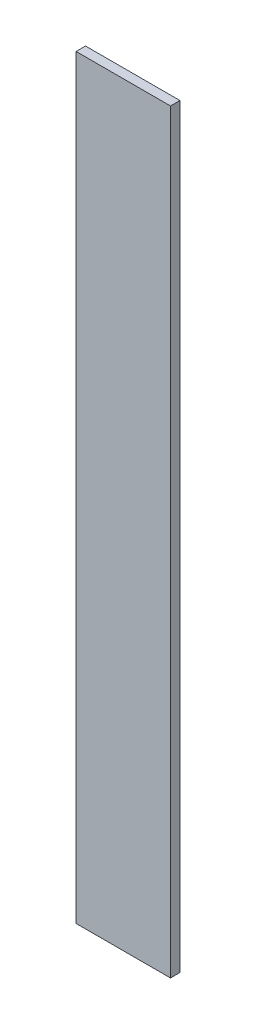
ISO-10303-21;
HEADER;
FILE_DESCRIPTION(('STEP AP214'),'2;1');
FILE_NAME('part.step','',(''),(''),'','','');
FILE_SCHEMA(('AUTOMOTIVE_DESIGN { 1 0 10303 214 1 1 1 1 }'));
ENDSEC;
DATA;
#1=APPLICATION_CONTEXT('core data for automotive mechanical design processes');
#2=APPLICATION_PROTOCOL_DEFINITION('international standard','automotive_design',2000,#1);
#3=PRODUCT_CONTEXT('',#1,'mechanical');
#4=PRODUCT('Part','Part','',(#3));
#5=PRODUCT_RELATED_PRODUCT_CATEGORY('part','',(#4));
#6=PRODUCT_DEFINITION_FORMATION('','',#4);
#7=PRODUCT_DEFINITION_CONTEXT('part definition',#1,'design');
#8=PRODUCT_DEFINITION('design','',#6,#7);
#9=PRODUCT_DEFINITION_SHAPE('','',#8);
#10=(LENGTH_UNIT() NAMED_UNIT(*) SI_UNIT(.MILLI.,.METRE.));
#11=(NAMED_UNIT(*) PLANE_ANGLE_UNIT() SI_UNIT($,.RADIAN.));
#12=(NAMED_UNIT(*) SI_UNIT($,.STERADIAN.) SOLID_ANGLE_UNIT());
#13=UNCERTAINTY_MEASURE_WITH_UNIT(LENGTH_MEASURE(1.E-05),#10,'distance_accuracy_value','');
#14=(GEOMETRIC_REPRESENTATION_CONTEXT(3) GLOBAL_UNCERTAINTY_ASSIGNED_CONTEXT((#13)) GLOBAL_UNIT_ASSIGNED_CONTEXT((#10,
#11,#12)) REPRESENTATION_CONTEXT('',''));
#15=CARTESIAN_POINT('',(0.,0.,0.));
#16=DIRECTION('',(0.,0.,1.));
#17=DIRECTION('',(1.,0.,0.));
#18=AXIS2_PLACEMENT_3D('',#15,#16,#17);
#19=CARTESIAN_POINT('',(12.7,-101.6,2.54));
#20=DIRECTION('',(-1.,0.,0.));
#21=DIRECTION('',(0.,0.,1.));
#22=AXIS2_PLACEMENT_3D('',#19,#20,#21);
#23=PLANE('',#22);
#24=DIRECTION('',(0.,1.,0.));
#25=VECTOR('',#24,1.);
#26=CARTESIAN_POINT('',(12.7,-101.6,0.));
#27=LINE('',#26,#25);
#28=CARTESIAN_POINT('',(12.7,-101.6,0.));
#29=VERTEX_POINT('',#28);
#30=CARTESIAN_POINT('',(12.7,101.6,0.));
#31=VERTEX_POINT('',#30);
#32=EDGE_CURVE('E96',#29,#31,#27,.T.);
#33=ORIENTED_EDGE('',*,*,#32,.T.);
#34=DIRECTION('',(0.,0.,-1.));
#35=VECTOR('',#34,1.);
#36=CARTESIAN_POINT('',(12.7,101.6,2.54));
#37=LINE('',#36,#35);
#38=CARTESIAN_POINT('',(12.7,101.6,2.54));
#39=VERTEX_POINT('',#38);
#40=EDGE_CURVE('E11',#39,#31,#37,.T.);
#41=ORIENTED_EDGE('',*,*,#40,.F.);
#42=DIRECTION('',(0.,1.,0.));
#43=VECTOR('',#42,1.);
#44=CARTESIAN_POINT('',(12.7,-101.6,2.54));
#45=LINE('',#44,#43);
#46=CARTESIAN_POINT('',(12.7,-101.6,2.54));
#47=VERTEX_POINT('',#46);
#48=EDGE_CURVE('E84',#47,#39,#45,.T.);
#49=ORIENTED_EDGE('',*,*,#48,.F.);
#50=DIRECTION('',(0.,0.,-1.));
#51=VECTOR('',#50,1.);
#52=CARTESIAN_POINT('',(12.7,-101.6,2.54));
#53=LINE('',#52,#51);
#54=EDGE_CURVE('E92',#47,#29,#53,.T.);
#55=ORIENTED_EDGE('',*,*,#54,.T.);
#56=EDGE_LOOP('',(#33,#41,#49,#55));
#57=FACE_BOUND('',#56,.T.);
#58=ADVANCED_FACE('F33',(#57),#23,.F.);
#59=CARTESIAN_POINT('',(-12.7,101.6,2.54));
#60=DIRECTION('',(0.,-1.,0.));
#61=DIRECTION('',(0.,0.,-1.));
#62=AXIS2_PLACEMENT_3D('',#59,#60,#61);
#63=PLANE('',#62);
#64=DIRECTION('',(-1.,0.,0.));
#65=VECTOR('',#64,1.);
#66=CARTESIAN_POINT('',(-12.7,101.6,0.));
#67=LINE('',#66,#65);
#68=CARTESIAN_POINT('',(-12.7,101.6,0.));
#69=VERTEX_POINT('',#68);
#70=EDGE_CURVE('E88',#31,#69,#67,.T.);
#71=ORIENTED_EDGE('',*,*,#70,.T.);
#72=DIRECTION('',(0.,0.,-1.));
#73=VECTOR('',#72,1.);
#74=CARTESIAN_POINT('',(-12.7,101.6,2.54));
#75=LINE('',#74,#73);
#76=CARTESIAN_POINT('',(-12.7,101.6,2.54));
#77=VERTEX_POINT('',#76);
#78=EDGE_CURVE('E41',#77,#69,#75,.T.);
#79=ORIENTED_EDGE('',*,*,#78,.F.);
#80=DIRECTION('',(-1.,0.,0.));
#81=VECTOR('',#80,1.);
#82=CARTESIAN_POINT('',(-12.7,101.6,2.54));
#83=LINE('',#82,#81);
#84=EDGE_CURVE('E79',#39,#77,#83,.T.);
#85=ORIENTED_EDGE('',*,*,#84,.F.);
#86=ORIENTED_EDGE('',*,*,#40,.T.);
#87=EDGE_LOOP('',(#71,#79,#85,#86));
#88=FACE_BOUND('',#87,.T.);
#89=ADVANCED_FACE('F87',(#88),#63,.F.);
#90=CARTESIAN_POINT('',(-12.7,-101.6,2.54));
#91=DIRECTION('',(1.,0.,0.));
#92=DIRECTION('',(0.,0.,-1.));
#93=AXIS2_PLACEMENT_3D('',#90,#91,#92);
#94=PLANE('',#93);
#95=DIRECTION('',(0.,-1.,0.));
#96=VECTOR('',#95,1.);
#97=CARTESIAN_POINT('',(-12.7,-101.6,0.));
#98=LINE('',#97,#96);
#99=CARTESIAN_POINT('',(-12.7,-101.6,0.));
#100=VERTEX_POINT('',#99);
#101=EDGE_CURVE('E66',#69,#100,#98,.T.);
#102=ORIENTED_EDGE('',*,*,#101,.T.);
#103=DIRECTION('',(0.,0.,-1.));
#104=VECTOR('',#103,1.);
#105=CARTESIAN_POINT('',(-12.7,-101.6,2.54));
#106=LINE('',#105,#104);
#107=CARTESIAN_POINT('',(-12.7,-101.6,2.54));
#108=VERTEX_POINT('',#107);
#109=EDGE_CURVE('E89',#108,#100,#106,.T.);
#110=ORIENTED_EDGE('',*,*,#109,.F.);
#111=DIRECTION('',(0.,-1.,0.));
#112=VECTOR('',#111,1.);
#113=CARTESIAN_POINT('',(-12.7,-101.6,2.54));
#114=LINE('',#113,#112);
#115=EDGE_CURVE('E82',#77,#108,#114,.T.);
#116=ORIENTED_EDGE('',*,*,#115,.F.);
#117=ORIENTED_EDGE('',*,*,#78,.T.);
#118=EDGE_LOOP('',(#102,#110,#116,#117));
#119=FACE_BOUND('',#118,.T.);
#120=ADVANCED_FACE('F90',(#119),#94,.F.);
#121=CARTESIAN_POINT('',(-12.7,-101.6,2.54));
#122=DIRECTION('',(0.,1.,0.));
#123=DIRECTION('',(0.,0.,1.));
#124=AXIS2_PLACEMENT_3D('',#121,#122,#123);
#125=PLANE('',#124);
#126=DIRECTION('',(1.,0.,0.));
#127=VECTOR('',#126,1.);
#128=CARTESIAN_POINT('',(-12.7,-101.6,0.));
#129=LINE('',#128,#127);
#130=EDGE_CURVE('E72',#100,#29,#129,.T.);
#131=ORIENTED_EDGE('',*,*,#130,.T.);
#132=ORIENTED_EDGE('',*,*,#54,.F.);
#133=DIRECTION('',(1.,0.,0.));
#134=VECTOR('',#133,1.);
#135=CARTESIAN_POINT('',(-12.7,-101.6,2.54));
#136=LINE('',#135,#134);
#137=EDGE_CURVE('E49',#108,#47,#136,.T.);
#138=ORIENTED_EDGE('',*,*,#137,.F.);
#139=ORIENTED_EDGE('',*,*,#109,.T.);
#140=EDGE_LOOP('',(#131,#132,#138,#139));
#141=FACE_BOUND('',#140,.T.);
#142=ADVANCED_FACE('F103',(#141),#125,.F.);
#143=CARTESIAN_POINT('',(0.,0.,2.54));
#144=DIRECTION('',(0.,0.,-1.));
#145=DIRECTION('',(-1.,0.,0.));
#146=AXIS2_PLACEMENT_3D('',#143,#144,#145);
#147=PLANE('',#146);
#148=ORIENTED_EDGE('',*,*,#48,.T.);
#149=ORIENTED_EDGE('',*,*,#84,.T.);
#150=ORIENTED_EDGE('',*,*,#115,.T.);
#151=ORIENTED_EDGE('',*,*,#137,.T.);
#152=EDGE_LOOP('',(#148,#149,#150,#151));
#153=FACE_BOUND('',#152,.T.);
#154=ADVANCED_FACE('F80',(#153),#147,.F.);
#155=CARTESIAN_POINT('',(0.,0.,0.));
#156=DIRECTION('',(0.,0.,-1.));
#157=DIRECTION('',(-1.,0.,0.));
#158=AXIS2_PLACEMENT_3D('',#155,#156,#157);
#159=PLANE('',#158);
#160=ORIENTED_EDGE('',*,*,#32,.F.);
#161=ORIENTED_EDGE('',*,*,#130,.F.);
#162=ORIENTED_EDGE('',*,*,#101,.F.);
#163=ORIENTED_EDGE('',*,*,#70,.F.);
#164=EDGE_LOOP('',(#160,#161,#162,#163));
#165=FACE_BOUND('',#164,.T.);
#166=ADVANCED_FACE('F106',(#165),#159,.T.);
#167=CLOSED_SHELL('',(#58,#89,#120,#142,#154,#166));
#168=MANIFOLD_SOLID_BREP('B2',#167);
#169=ADVANCED_BREP_SHAPE_REPRESENTATION('',(#18,#168),#14);
#170=SHAPE_DEFINITION_REPRESENTATION(#9,#169);
ENDSEC;
END-ISO-10303-21;
